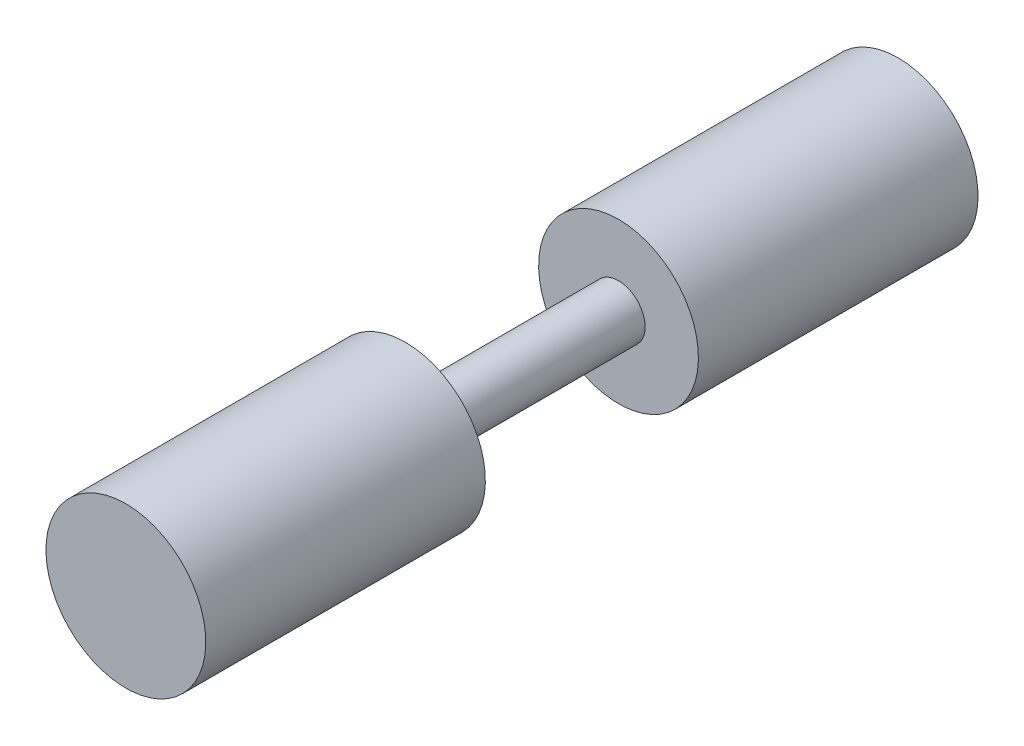
ISO-10303-21;
HEADER;
FILE_DESCRIPTION(('STEP AP214'),'2;1');
FILE_NAME('part.step','',(''),(''),'','','');
FILE_SCHEMA(('AUTOMOTIVE_DESIGN { 1 0 10303 214 1 1 1 1 }'));
ENDSEC;
DATA;
#1=APPLICATION_CONTEXT('core data for automotive mechanical design processes');
#2=APPLICATION_PROTOCOL_DEFINITION('international standard','automotive_design',2000,#1);
#3=PRODUCT_CONTEXT('',#1,'mechanical');
#4=PRODUCT('Part','Part','',(#3));
#5=PRODUCT_RELATED_PRODUCT_CATEGORY('part','',(#4));
#6=PRODUCT_DEFINITION_FORMATION('','',#4);
#7=PRODUCT_DEFINITION_CONTEXT('part definition',#1,'design');
#8=PRODUCT_DEFINITION('design','',#6,#7);
#9=PRODUCT_DEFINITION_SHAPE('','',#8);
#10=(LENGTH_UNIT() NAMED_UNIT(*) SI_UNIT(.MILLI.,.METRE.));
#11=(NAMED_UNIT(*) PLANE_ANGLE_UNIT() SI_UNIT($,.RADIAN.));
#12=(NAMED_UNIT(*) SI_UNIT($,.STERADIAN.) SOLID_ANGLE_UNIT());
#13=UNCERTAINTY_MEASURE_WITH_UNIT(LENGTH_MEASURE(1.E-05),#10,'distance_accuracy_value','');
#14=(GEOMETRIC_REPRESENTATION_CONTEXT(3) GLOBAL_UNCERTAINTY_ASSIGNED_CONTEXT((#13)) GLOBAL_UNIT_ASSIGNED_CONTEXT((#10,
#11,#12)) REPRESENTATION_CONTEXT('',''));
#15=CARTESIAN_POINT('',(0.,0.,0.));
#16=DIRECTION('',(0.,0.,1.));
#17=DIRECTION('',(1.,0.,0.));
#18=AXIS2_PLACEMENT_3D('',#15,#16,#17);
#19=CARTESIAN_POINT('',(0.,0.,-92.075));
#20=DIRECTION('',(0.,0.,-1.));
#21=DIRECTION('',(0.,1.,0.));
#22=AXIS2_PLACEMENT_3D('',#19,#20,#21);
#23=CYLINDRICAL_SURFACE('',#22,19.05);
#24=CARTESIAN_POINT('',(0.,0.,-25.4));
#25=DIRECTION('',(0.,0.,-1.));
#26=DIRECTION('',(0.,1.,0.));
#27=AXIS2_PLACEMENT_3D('',#24,#25,#26);
#28=CIRCLE('',#27,19.05);
#29=CARTESIAN_POINT('',(0.,19.05,-25.4));
#30=VERTEX_POINT('',#29);
#31=EDGE_CURVE('E53',#30,#30,#28,.T.);
#32=ORIENTED_EDGE('',*,*,#31,.T.);
#33=EDGE_LOOP('',(#32));
#34=FACE_BOUND('',#33,.T.);
#35=CARTESIAN_POINT('',(0.,0.,-92.075));
#36=DIRECTION('',(0.,0.,-1.));
#37=DIRECTION('',(0.,1.,0.));
#38=AXIS2_PLACEMENT_3D('',#35,#36,#37);
#39=CIRCLE('',#38,19.05);
#40=CARTESIAN_POINT('',(0.,19.05,-92.075));
#41=VERTEX_POINT('',#40);
#42=EDGE_CURVE('E10',#41,#41,#39,.T.);
#43=ORIENTED_EDGE('',*,*,#42,.F.);
#44=EDGE_LOOP('',(#43));
#45=FACE_BOUND('',#44,.T.);
#46=ADVANCED_FACE('F31',(#34,#45),#23,.T.);
#47=CARTESIAN_POINT('',(0.,19.05,-92.075));
#48=DIRECTION('',(0.,0.,-1.));
#49=DIRECTION('',(0.,1.,0.));
#50=AXIS2_PLACEMENT_3D('',#47,#48,#49);
#51=PLANE('',#50);
#52=ORIENTED_EDGE('',*,*,#42,.T.);
#53=EDGE_LOOP('',(#52));
#54=FACE_BOUND('',#53,.T.);
#55=ADVANCED_FACE('F71',(#54),#51,.T.);
#56=CARTESIAN_POINT('',(0.,0.,92.075));
#57=DIRECTION('',(0.,0.,1.));
#58=DIRECTION('',(0.,-1.,0.));
#59=AXIS2_PLACEMENT_3D('',#56,#57,#58);
#60=PLANE('',#59);
#61=CARTESIAN_POINT('',(0.,0.,92.075));
#62=DIRECTION('',(0.,0.,-1.));
#63=DIRECTION('',(0.,1.,0.));
#64=AXIS2_PLACEMENT_3D('',#61,#62,#63);
#65=CIRCLE('',#64,19.05);
#66=CARTESIAN_POINT('',(0.,19.05,92.075));
#67=VERTEX_POINT('',#66);
#68=EDGE_CURVE('E37',#67,#67,#65,.T.);
#69=ORIENTED_EDGE('',*,*,#68,.F.);
#70=EDGE_LOOP('',(#69));
#71=FACE_BOUND('',#70,.T.);
#72=ADVANCED_FACE('F75',(#71),#60,.T.);
#73=CARTESIAN_POINT('',(0.,0.,-92.075));
#74=DIRECTION('',(0.,0.,-1.));
#75=DIRECTION('',(0.,1.,0.));
#76=AXIS2_PLACEMENT_3D('',#73,#74,#75);
#77=CYLINDRICAL_SURFACE('',#76,19.05);
#78=ORIENTED_EDGE('',*,*,#68,.T.);
#79=EDGE_LOOP('',(#78));
#80=FACE_BOUND('',#79,.T.);
#81=CARTESIAN_POINT('',(0.,0.,25.4));
#82=DIRECTION('',(0.,0.,-1.));
#83=DIRECTION('',(0.,1.,0.));
#84=AXIS2_PLACEMENT_3D('',#81,#82,#83);
#85=CIRCLE('',#84,19.05);
#86=CARTESIAN_POINT('',(0.,19.05,25.4));
#87=VERTEX_POINT('',#86);
#88=EDGE_CURVE('E41',#87,#87,#85,.T.);
#89=ORIENTED_EDGE('',*,*,#88,.F.);
#90=EDGE_LOOP('',(#89));
#91=FACE_BOUND('',#90,.T.);
#92=ADVANCED_FACE('F79',(#80,#91),#77,.T.);
#93=CARTESIAN_POINT('',(0.,19.05,25.4));
#94=DIRECTION('',(0.,0.,-1.));
#95=DIRECTION('',(0.,1.,0.));
#96=AXIS2_PLACEMENT_3D('',#93,#94,#95);
#97=PLANE('',#96);
#98=ORIENTED_EDGE('',*,*,#88,.T.);
#99=EDGE_LOOP('',(#98));
#100=FACE_BOUND('',#99,.T.);
#101=CARTESIAN_POINT('',(0.,0.,25.4));
#102=DIRECTION('',(0.,0.,-1.));
#103=DIRECTION('',(0.,1.,0.));
#104=AXIS2_PLACEMENT_3D('',#101,#102,#103);
#105=CIRCLE('',#104,6.35);
#106=CARTESIAN_POINT('',(0.,6.34999999999998,25.4));
#107=VERTEX_POINT('',#106);
#108=EDGE_CURVE('E45',#107,#107,#105,.T.);
#109=ORIENTED_EDGE('',*,*,#108,.F.);
#110=EDGE_LOOP('',(#109));
#111=FACE_BOUND('',#110,.T.);
#112=ADVANCED_FACE('F67',(#100,#111),#97,.T.);
#113=CARTESIAN_POINT('',(0.,0.,-92.075));
#114=DIRECTION('',(0.,0.,-1.));
#115=DIRECTION('',(0.,1.,0.));
#116=AXIS2_PLACEMENT_3D('',#113,#114,#115);
#117=CYLINDRICAL_SURFACE('',#116,6.35);
#118=ORIENTED_EDGE('',*,*,#108,.T.);
#119=EDGE_LOOP('',(#118));
#120=FACE_BOUND('',#119,.T.);
#121=CARTESIAN_POINT('',(0.,0.,-25.4));
#122=DIRECTION('',(0.,0.,-1.));
#123=DIRECTION('',(0.,1.,0.));
#124=AXIS2_PLACEMENT_3D('',#121,#122,#123);
#125=CIRCLE('',#124,6.35);
#126=CARTESIAN_POINT('',(0.,6.34999999999998,-25.4));
#127=VERTEX_POINT('',#126);
#128=EDGE_CURVE('E50',#127,#127,#125,.T.);
#129=ORIENTED_EDGE('',*,*,#128,.F.);
#130=EDGE_LOOP('',(#129));
#131=FACE_BOUND('',#130,.T.);
#132=ADVANCED_FACE('F61',(#120,#131),#117,.T.);
#133=CARTESIAN_POINT('',(0.,6.34999999999998,-25.4));
#134=DIRECTION('',(0.,0.,1.));
#135=DIRECTION('',(0.,-1.,0.));
#136=AXIS2_PLACEMENT_3D('',#133,#134,#135);
#137=PLANE('',#136);
#138=ORIENTED_EDGE('',*,*,#128,.T.);
#139=EDGE_LOOP('',(#138));
#140=FACE_BOUND('',#139,.T.);
#141=ORIENTED_EDGE('',*,*,#31,.F.);
#142=EDGE_LOOP('',(#141));
#143=FACE_BOUND('',#142,.T.);
#144=ADVANCED_FACE('F59',(#140,#143),#137,.T.);
#145=CLOSED_SHELL('',(#46,#55,#72,#92,#112,#132,#144));
#146=MANIFOLD_SOLID_BREP('B2',#145);
#147=ADVANCED_BREP_SHAPE_REPRESENTATION('',(#18,#146),#14);
#148=SHAPE_DEFINITION_REPRESENTATION(#9,#147);
ENDSEC;
END-ISO-10303-21;
